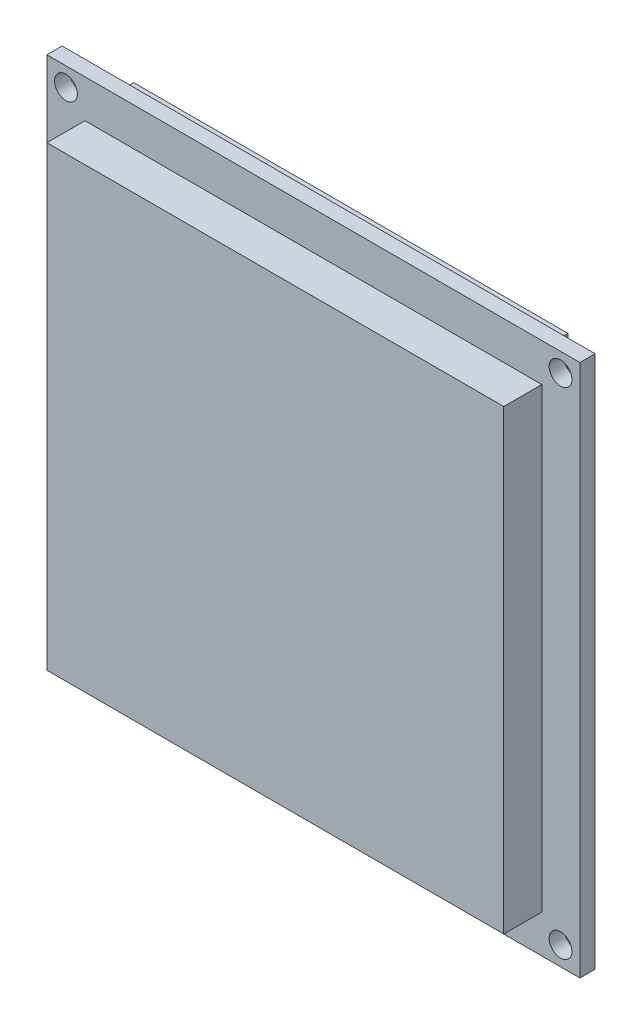
ISO-10303-21;
HEADER;
FILE_DESCRIPTION(('STEP AP214'),'2;1');
FILE_NAME('part.step','',(''),(''),'','','');
FILE_SCHEMA(('AUTOMOTIVE_DESIGN { 1 0 10303 214 1 1 1 1 }'));
ENDSEC;
DATA;
#1=APPLICATION_CONTEXT('core data for automotive mechanical design processes');
#2=APPLICATION_PROTOCOL_DEFINITION('international standard','automotive_design',2000,#1);
#3=PRODUCT_CONTEXT('',#1,'mechanical');
#4=PRODUCT('Part','Part','',(#3));
#5=PRODUCT_RELATED_PRODUCT_CATEGORY('part','',(#4));
#6=PRODUCT_DEFINITION_FORMATION('','',#4);
#7=PRODUCT_DEFINITION_CONTEXT('part definition',#1,'design');
#8=PRODUCT_DEFINITION('design','',#6,#7);
#9=PRODUCT_DEFINITION_SHAPE('','',#8);
#10=(LENGTH_UNIT() NAMED_UNIT(*) SI_UNIT(.MILLI.,.METRE.));
#11=(NAMED_UNIT(*) PLANE_ANGLE_UNIT() SI_UNIT($,.RADIAN.));
#12=(NAMED_UNIT(*) SI_UNIT($,.STERADIAN.) SOLID_ANGLE_UNIT());
#13=UNCERTAINTY_MEASURE_WITH_UNIT(LENGTH_MEASURE(1.E-05),#10,'distance_accuracy_value','');
#14=(GEOMETRIC_REPRESENTATION_CONTEXT(3) GLOBAL_UNCERTAINTY_ASSIGNED_CONTEXT((#13)) GLOBAL_UNIT_ASSIGNED_CONTEXT((#10,
#11,#12)) REPRESENTATION_CONTEXT('',''));
#15=CARTESIAN_POINT('',(0.,0.,0.));
#16=DIRECTION('',(0.,0.,1.));
#17=DIRECTION('',(1.,0.,0.));
#18=AXIS2_PLACEMENT_3D('',#15,#16,#17);
#19=CARTESIAN_POINT('',(28.4514096874915,0.,-3.));
#20=DIRECTION('',(-1.,0.,0.));
#21=DIRECTION('',(0.,0.,1.));
#22=AXIS2_PLACEMENT_3D('',#19,#20,#21);
#23=PLANE('',#22);
#24=DIRECTION('',(0.,-1.,0.));
#25=VECTOR('',#24,1.);
#26=CARTESIAN_POINT('',(28.4514096874915,0.,0.));
#27=LINE('',#26,#25);
#28=CARTESIAN_POINT('',(28.4514096874915,32.5200304427109,0.));
#29=VERTEX_POINT('',#28);
#30=CARTESIAN_POINT('',(28.4514096874915,11.4523529624222,0.));
#31=VERTEX_POINT('',#30);
#32=EDGE_CURVE('E318',#29,#31,#27,.T.);
#33=ORIENTED_EDGE('',*,*,#32,.T.);
#34=DIRECTION('',(0.,0.,1.));
#35=VECTOR('',#34,1.);
#36=CARTESIAN_POINT('',(28.4514096874915,11.4523529624222,-3.));
#37=LINE('',#36,#35);
#38=CARTESIAN_POINT('',(28.4514096874915,11.4523529624222,-3.));
#39=VERTEX_POINT('',#38);
#40=EDGE_CURVE('E13',#39,#31,#37,.T.);
#41=ORIENTED_EDGE('',*,*,#40,.F.);
#42=DIRECTION('',(0.,-1.,0.));
#43=VECTOR('',#42,1.);
#44=CARTESIAN_POINT('',(28.4514096874915,0.,-3.));
#45=LINE('',#44,#43);
#46=CARTESIAN_POINT('',(28.4514096874915,32.5200304427109,-3.));
#47=VERTEX_POINT('',#46);
#48=EDGE_CURVE('E274',#47,#39,#45,.T.);
#49=ORIENTED_EDGE('',*,*,#48,.F.);
#50=DIRECTION('',(0.,0.,1.));
#51=VECTOR('',#50,1.);
#52=CARTESIAN_POINT('',(28.4514096874915,32.5200304427109,-3.));
#53=LINE('',#52,#51);
#54=EDGE_CURVE('E259',#47,#29,#53,.T.);
#55=ORIENTED_EDGE('',*,*,#54,.T.);
#56=EDGE_LOOP('',(#33,#41,#49,#55));
#57=FACE_BOUND('',#56,.T.);
#58=ADVANCED_FACE('F256',(#57),#23,.F.);
#59=CARTESIAN_POINT('',(0.,11.4523529624222,-3.));
#60=DIRECTION('',(0.,-1.,0.));
#61=DIRECTION('',(0.,0.,-1.));
#62=AXIS2_PLACEMENT_3D('',#59,#60,#61);
#63=PLANE('',#62);
#64=DIRECTION('',(1.,0.,0.));
#65=VECTOR('',#64,1.);
#66=CARTESIAN_POINT('',(0.,11.4523529624222,0.));
#67=LINE('',#66,#65);
#68=CARTESIAN_POINT('',(-28.5744722630188,11.4523529624222,0.));
#69=VERTEX_POINT('',#68);
#70=EDGE_CURVE('E323',#69,#31,#67,.T.);
#71=ORIENTED_EDGE('',*,*,#70,.F.);
#72=DIRECTION('',(0.,0.,1.));
#73=VECTOR('',#72,1.);
#74=CARTESIAN_POINT('',(-28.5744722630188,11.4523529624222,-3.));
#75=LINE('',#74,#73);
#76=CARTESIAN_POINT('',(-28.5744722630188,11.4523529624222,-3.));
#77=VERTEX_POINT('',#76);
#78=EDGE_CURVE('E265',#77,#69,#75,.T.);
#79=ORIENTED_EDGE('',*,*,#78,.F.);
#80=DIRECTION('',(1.,0.,0.));
#81=VECTOR('',#80,1.);
#82=CARTESIAN_POINT('',(0.,11.4523529624222,-3.));
#83=LINE('',#82,#81);
#84=EDGE_CURVE('E313',#77,#39,#83,.T.);
#85=ORIENTED_EDGE('',*,*,#84,.T.);
#86=ORIENTED_EDGE('',*,*,#40,.T.);
#87=EDGE_LOOP('',(#71,#79,#85,#86));
#88=FACE_BOUND('',#87,.T.);
#89=ADVANCED_FACE('F329',(#88),#63,.T.);
#90=CARTESIAN_POINT('',(-28.5744722630188,0.,-3.));
#91=DIRECTION('',(-1.,0.,0.));
#92=DIRECTION('',(0.,0.,1.));
#93=AXIS2_PLACEMENT_3D('',#90,#91,#92);
#94=PLANE('',#93);
#95=DIRECTION('',(0.,-1.,0.));
#96=VECTOR('',#95,1.);
#97=CARTESIAN_POINT('',(-28.5744722630188,0.,0.));
#98=LINE('',#97,#96);
#99=CARTESIAN_POINT('',(-28.5744722630188,32.5200304427109,0.));
#100=VERTEX_POINT('',#99);
#101=EDGE_CURVE('E306',#100,#69,#98,.T.);
#102=ORIENTED_EDGE('',*,*,#101,.F.);
#103=DIRECTION('',(0.,0.,1.));
#104=VECTOR('',#103,1.);
#105=CARTESIAN_POINT('',(-28.5744722630188,32.5200304427109,-3.));
#106=LINE('',#105,#104);
#107=CARTESIAN_POINT('',(-28.5744722630188,32.5200304427109,-3.));
#108=VERTEX_POINT('',#107);
#109=EDGE_CURVE('E303',#108,#100,#106,.T.);
#110=ORIENTED_EDGE('',*,*,#109,.F.);
#111=DIRECTION('',(0.,-1.,0.));
#112=VECTOR('',#111,1.);
#113=CARTESIAN_POINT('',(-28.5744722630188,0.,-3.));
#114=LINE('',#113,#112);
#115=EDGE_CURVE('E305',#108,#77,#114,.T.);
#116=ORIENTED_EDGE('',*,*,#115,.T.);
#117=ORIENTED_EDGE('',*,*,#78,.T.);
#118=EDGE_LOOP('',(#102,#110,#116,#117));
#119=FACE_BOUND('',#118,.T.);
#120=ADVANCED_FACE('F304',(#119),#94,.T.);
#121=CARTESIAN_POINT('',(0.,32.5200304427109,-3.));
#122=DIRECTION('',(0.,-1.,0.));
#123=DIRECTION('',(0.,0.,-1.));
#124=AXIS2_PLACEMENT_3D('',#121,#122,#123);
#125=PLANE('',#124);
#126=DIRECTION('',(1.,0.,0.));
#127=VECTOR('',#126,1.);
#128=CARTESIAN_POINT('',(0.,32.5200304427109,0.));
#129=LINE('',#128,#127);
#130=EDGE_CURVE('E320',#100,#29,#129,.T.);
#131=ORIENTED_EDGE('',*,*,#130,.T.);
#132=ORIENTED_EDGE('',*,*,#54,.F.);
#133=DIRECTION('',(1.,0.,0.));
#134=VECTOR('',#133,1.);
#135=CARTESIAN_POINT('',(0.,32.5200304427109,-3.));
#136=LINE('',#135,#134);
#137=EDGE_CURVE('E300',#108,#47,#136,.T.);
#138=ORIENTED_EDGE('',*,*,#137,.F.);
#139=ORIENTED_EDGE('',*,*,#109,.T.);
#140=EDGE_LOOP('',(#131,#132,#138,#139));
#141=FACE_BOUND('',#140,.T.);
#142=ADVANCED_FACE('F309',(#141),#125,.F.);
#143=CARTESIAN_POINT('',(0.,0.,-3.));
#144=DIRECTION('',(0.,0.,1.));
#145=DIRECTION('',(1.,0.,0.));
#146=AXIS2_PLACEMENT_3D('',#143,#144,#145);
#147=PLANE('',#146);
#148=ORIENTED_EDGE('',*,*,#48,.T.);
#149=ORIENTED_EDGE('',*,*,#84,.F.);
#150=ORIENTED_EDGE('',*,*,#115,.F.);
#151=ORIENTED_EDGE('',*,*,#137,.T.);
#152=EDGE_LOOP('',(#148,#149,#150,#151));
#153=FACE_BOUND('',#152,.T.);
#154=ADVANCED_FACE('F312',(#153),#147,.F.);
#155=CARTESIAN_POINT('',(0.,0.,0.));
#156=DIRECTION('',(0.,0.,1.));
#157=DIRECTION('',(1.,0.,0.));
#158=AXIS2_PLACEMENT_3D('',#155,#156,#157);
#159=PLANE('',#158);
#160=ORIENTED_EDGE('',*,*,#32,.F.);
#161=ORIENTED_EDGE('',*,*,#130,.F.);
#162=ORIENTED_EDGE('',*,*,#101,.T.);
#163=ORIENTED_EDGE('',*,*,#70,.T.);
#164=EDGE_LOOP('',(#160,#161,#162,#163));
#165=FACE_BOUND('',#164,.T.);
#166=ADVANCED_FACE('F328',(#165),#159,.T.);
#167=CLOSED_SHELL('',(#58,#89,#120,#142,#154,#166));
#168=MANIFOLD_SOLID_BREP('B2',#167);
#169=CARTESIAN_POINT('',(-11.0428094319523,0.,-3.));
#170=DIRECTION('',(1.,0.,0.));
#171=DIRECTION('',(0.,0.,-1.));
#172=AXIS2_PLACEMENT_3D('',#169,#170,#171);
#173=PLANE('',#172);
#174=DIRECTION('',(0.,1.,0.));
#175=VECTOR('',#174,1.);
#176=CARTESIAN_POINT('',(-11.0428094319523,0.,0.));
#177=LINE('',#176,#175);
#178=CARTESIAN_POINT('',(-11.0428094319523,-35.0200304427109,0.));
#179=VERTEX_POINT('',#178);
#180=CARTESIAN_POINT('',(-11.0428094319523,-28.4262912070403,0.));
#181=VERTEX_POINT('',#180);
#182=EDGE_CURVE('E509',#179,#181,#177,.T.);
#183=ORIENTED_EDGE('',*,*,#182,.T.);
#184=DIRECTION('',(0.,0.,1.));
#185=VECTOR('',#184,1.);
#186=CARTESIAN_POINT('',(-11.0428094319523,-28.4262912070403,-3.));
#187=LINE('',#186,#185);
#188=CARTESIAN_POINT('',(-11.0428094319523,-28.4262912070403,-3.));
#189=VERTEX_POINT('',#188);
#190=EDGE_CURVE('E254',#189,#181,#187,.T.);
#191=ORIENTED_EDGE('',*,*,#190,.F.);
#192=DIRECTION('',(0.,1.,0.));
#193=VECTOR('',#192,1.);
#194=CARTESIAN_POINT('',(-11.0428094319523,0.,-3.));
#195=LINE('',#194,#193);
#196=CARTESIAN_POINT('',(-11.0428094319523,-35.0200304427109,-3.));
#197=VERTEX_POINT('',#196);
#198=EDGE_CURVE('E422',#197,#189,#195,.T.);
#199=ORIENTED_EDGE('',*,*,#198,.F.);
#200=DIRECTION('',(0.,0.,1.));
#201=VECTOR('',#200,1.);
#202=CARTESIAN_POINT('',(-11.0428094319523,-35.0200304427109,-3.));
#203=LINE('',#202,#201);
#204=EDGE_CURVE('E400',#197,#179,#203,.T.);
#205=ORIENTED_EDGE('',*,*,#204,.T.);
#206=EDGE_LOOP('',(#183,#191,#199,#205));
#207=FACE_BOUND('',#206,.T.);
#208=ADVANCED_FACE('F397',(#207),#173,.F.);
#209=CARTESIAN_POINT('',(0.,-28.4262912070403,-3.));
#210=DIRECTION('',(0.,1.,0.));
#211=DIRECTION('',(0.,0.,1.));
#212=AXIS2_PLACEMENT_3D('',#209,#210,#211);
#213=PLANE('',#212);
#214=DIRECTION('',(-1.,0.,0.));
#215=VECTOR('',#214,1.);
#216=CARTESIAN_POINT('',(0.,-28.4262912070403,0.));
#217=LINE('',#216,#215);
#218=CARTESIAN_POINT('',(11.0828703173741,-28.4262912070403,0.));
#219=VERTEX_POINT('',#218);
#220=EDGE_CURVE('E511',#219,#181,#217,.T.);
#221=ORIENTED_EDGE('',*,*,#220,.F.);
#222=DIRECTION('',(0.,0.,1.));
#223=VECTOR('',#222,1.);
#224=CARTESIAN_POINT('',(11.0828703173741,-28.4262912070403,-3.));
#225=LINE('',#224,#223);
#226=CARTESIAN_POINT('',(11.0828703173741,-28.4262912070403,-3.));
#227=VERTEX_POINT('',#226);
#228=EDGE_CURVE('E405',#227,#219,#225,.T.);
#229=ORIENTED_EDGE('',*,*,#228,.F.);
#230=DIRECTION('',(-1.,0.,0.));
#231=VECTOR('',#230,1.);
#232=CARTESIAN_POINT('',(0.,-28.4262912070403,-3.));
#233=LINE('',#232,#231);
#234=EDGE_CURVE('E516',#227,#189,#233,.T.);
#235=ORIENTED_EDGE('',*,*,#234,.T.);
#236=ORIENTED_EDGE('',*,*,#190,.T.);
#237=EDGE_LOOP('',(#221,#229,#235,#236));
#238=FACE_BOUND('',#237,.T.);
#239=ADVANCED_FACE('F535',(#238),#213,.T.);
#240=CARTESIAN_POINT('',(11.0828703173741,0.,-3.));
#241=DIRECTION('',(1.,0.,0.));
#242=DIRECTION('',(0.,0.,-1.));
#243=AXIS2_PLACEMENT_3D('',#240,#241,#242);
#244=PLANE('',#243);
#245=DIRECTION('',(0.,1.,0.));
#246=VECTOR('',#245,1.);
#247=CARTESIAN_POINT('',(11.0828703173741,0.,0.));
#248=LINE('',#247,#246);
#249=CARTESIAN_POINT('',(11.0828703173741,-35.0200304427109,0.));
#250=VERTEX_POINT('',#249);
#251=EDGE_CURVE('E521',#250,#219,#248,.T.);
#252=ORIENTED_EDGE('',*,*,#251,.F.);
#253=DIRECTION('',(0.,0.,1.));
#254=VECTOR('',#253,1.);
#255=CARTESIAN_POINT('',(11.0828703173741,-35.0200304427109,-3.));
#256=LINE('',#255,#254);
#257=CARTESIAN_POINT('',(11.0828703173741,-35.0200304427109,-3.));
#258=VERTEX_POINT('',#257);
#259=EDGE_CURVE('E526',#258,#250,#256,.T.);
#260=ORIENTED_EDGE('',*,*,#259,.F.);
#261=DIRECTION('',(0.,1.,0.));
#262=VECTOR('',#261,1.);
#263=CARTESIAN_POINT('',(11.0828703173741,0.,-3.));
#264=LINE('',#263,#262);
#265=EDGE_CURVE('E513',#258,#227,#264,.T.);
#266=ORIENTED_EDGE('',*,*,#265,.T.);
#267=ORIENTED_EDGE('',*,*,#228,.T.);
#268=EDGE_LOOP('',(#252,#260,#266,#267));
#269=FACE_BOUND('',#268,.T.);
#270=ADVANCED_FACE('F537',(#269),#244,.T.);
#271=CARTESIAN_POINT('',(0.,-35.0200304427109,-3.));
#272=DIRECTION('',(0.,1.,0.));
#273=DIRECTION('',(0.,0.,1.));
#274=AXIS2_PLACEMENT_3D('',#271,#272,#273);
#275=PLANE('',#274);
#276=DIRECTION('',(0.,0.,-1.));
#277=VECTOR('',#276,1.);
#278=CARTESIAN_POINT('',(-10.5428094319523,-35.0200304427109,-0.5));
#279=LINE('',#278,#277);
#280=CARTESIAN_POINT('',(-10.5428094319523,-35.0200304427109,-0.5));
#281=VERTEX_POINT('',#280);
#282=CARTESIAN_POINT('',(-10.5428094319523,-35.0200304427109,-2.5));
#283=VERTEX_POINT('',#282);
#284=EDGE_CURVE('E495',#281,#283,#279,.T.);
#285=ORIENTED_EDGE('',*,*,#284,.F.);
#286=DIRECTION('',(-1.,0.,0.));
#287=VECTOR('',#286,1.);
#288=CARTESIAN_POINT('',(10.5828703173741,-35.0200304427109,-0.5));
#289=LINE('',#288,#287);
#290=CARTESIAN_POINT('',(10.5828703173741,-35.0200304427109,-0.5));
#291=VERTEX_POINT('',#290);
#292=EDGE_CURVE('E488',#291,#281,#289,.T.);
#293=ORIENTED_EDGE('',*,*,#292,.F.);
#294=DIRECTION('',(0.,0.,1.));
#295=VECTOR('',#294,1.);
#296=CARTESIAN_POINT('',(10.5828703173741,-35.0200304427109,-2.5));
#297=LINE('',#296,#295);
#298=CARTESIAN_POINT('',(10.5828703173741,-35.0200304427109,-2.5));
#299=VERTEX_POINT('',#298);
#300=EDGE_CURVE('E499',#299,#291,#297,.T.);
#301=ORIENTED_EDGE('',*,*,#300,.F.);
#302=DIRECTION('',(1.,0.,0.));
#303=VECTOR('',#302,1.);
#304=CARTESIAN_POINT('',(-10.5428094319523,-35.0200304427109,-2.5));
#305=LINE('',#304,#303);
#306=EDGE_CURVE('E413',#283,#299,#305,.T.);
#307=ORIENTED_EDGE('',*,*,#306,.F.);
#308=EDGE_LOOP('',(#285,#293,#301,#307));
#309=FACE_BOUND('',#308,.T.);
#310=DIRECTION('',(-1.,0.,0.));
#311=VECTOR('',#310,1.);
#312=CARTESIAN_POINT('',(0.,-35.0200304427109,0.));
#313=LINE('',#312,#311);
#314=EDGE_CURVE('E519',#250,#179,#313,.T.);
#315=ORIENTED_EDGE('',*,*,#314,.T.);
#316=ORIENTED_EDGE('',*,*,#204,.F.);
#317=DIRECTION('',(-1.,0.,0.));
#318=VECTOR('',#317,1.);
#319=CARTESIAN_POINT('',(0.,-35.0200304427109,-3.));
#320=LINE('',#319,#318);
#321=EDGE_CURVE('E447',#258,#197,#320,.T.);
#322=ORIENTED_EDGE('',*,*,#321,.F.);
#323=ORIENTED_EDGE('',*,*,#259,.T.);
#324=EDGE_LOOP('',(#315,#316,#322,#323));
#325=FACE_BOUND('',#324,.T.);
#326=ADVANCED_FACE('F540',(#309,#325),#275,.F.);
#327=CARTESIAN_POINT('',(0.,0.,-3.));
#328=DIRECTION('',(0.,0.,1.));
#329=DIRECTION('',(1.,0.,0.));
#330=AXIS2_PLACEMENT_3D('',#327,#328,#329);
#331=PLANE('',#330);
#332=ORIENTED_EDGE('',*,*,#198,.T.);
#333=ORIENTED_EDGE('',*,*,#234,.F.);
#334=ORIENTED_EDGE('',*,*,#265,.F.);
#335=ORIENTED_EDGE('',*,*,#321,.T.);
#336=EDGE_LOOP('',(#332,#333,#334,#335));
#337=FACE_BOUND('',#336,.T.);
#338=ADVANCED_FACE('F538',(#337),#331,.F.);
#339=CARTESIAN_POINT('',(0.,0.,0.));
#340=DIRECTION('',(0.,0.,1.));
#341=DIRECTION('',(1.,0.,0.));
#342=AXIS2_PLACEMENT_3D('',#339,#340,#341);
#343=PLANE('',#342);
#344=ORIENTED_EDGE('',*,*,#182,.F.);
#345=ORIENTED_EDGE('',*,*,#314,.F.);
#346=ORIENTED_EDGE('',*,*,#251,.T.);
#347=ORIENTED_EDGE('',*,*,#220,.T.);
#348=EDGE_LOOP('',(#344,#345,#346,#347));
#349=FACE_BOUND('',#348,.T.);
#350=ADVANCED_FACE('F533',(#349),#343,.T.);
#351=CARTESIAN_POINT('',(0.,-29.4262912070403,-3.));
#352=DIRECTION('',(0.,1.,0.));
#353=DIRECTION('',(0.,0.,1.));
#354=AXIS2_PLACEMENT_3D('',#351,#352,#353);
#355=PLANE('',#354);
#356=DIRECTION('',(0.,0.,1.));
#357=VECTOR('',#356,1.);
#358=CARTESIAN_POINT('',(10.5828703173741,-29.4262912070403,-2.5));
#359=LINE('',#358,#357);
#360=CARTESIAN_POINT('',(10.5828703173741,-29.4262912070403,-2.5));
#361=VERTEX_POINT('',#360);
#362=CARTESIAN_POINT('',(10.5828703173741,-29.4262912070403,-0.5));
#363=VERTEX_POINT('',#362);
#364=EDGE_CURVE('E492',#361,#363,#359,.T.);
#365=ORIENTED_EDGE('',*,*,#364,.T.);
#366=DIRECTION('',(-1.,0.,0.));
#367=VECTOR('',#366,1.);
#368=CARTESIAN_POINT('',(10.5828703173741,-29.4262912070403,-0.5));
#369=LINE('',#368,#367);
#370=CARTESIAN_POINT('',(-10.5428094319523,-29.4262912070403,-0.5));
#371=VERTEX_POINT('',#370);
#372=EDGE_CURVE('E485',#363,#371,#369,.T.);
#373=ORIENTED_EDGE('',*,*,#372,.T.);
#374=DIRECTION('',(0.,0.,-1.));
#375=VECTOR('',#374,1.);
#376=CARTESIAN_POINT('',(-10.5428094319523,-29.4262912070403,-0.5));
#377=LINE('',#376,#375);
#378=CARTESIAN_POINT('',(-10.5428094319523,-29.4262912070403,-2.5));
#379=VERTEX_POINT('',#378);
#380=EDGE_CURVE('E472',#371,#379,#377,.T.);
#381=ORIENTED_EDGE('',*,*,#380,.T.);
#382=DIRECTION('',(1.,0.,0.));
#383=VECTOR('',#382,1.);
#384=CARTESIAN_POINT('',(-10.5428094319523,-29.4262912070403,-2.5));
#385=LINE('',#384,#383);
#386=EDGE_CURVE('E504',#379,#361,#385,.T.);
#387=ORIENTED_EDGE('',*,*,#386,.T.);
#388=EDGE_LOOP('',(#365,#373,#381,#387));
#389=FACE_BOUND('',#388,.T.);
#390=ADVANCED_FACE('F491',(#389),#355,.F.);
#391=CARTESIAN_POINT('',(10.5828703173741,-7.20615113042677,-0.5));
#392=DIRECTION('',(0.,0.,1.));
#393=DIRECTION('',(1.,0.,0.));
#394=AXIS2_PLACEMENT_3D('',#391,#392,#393);
#395=PLANE('',#394);
#396=DIRECTION('',(0.,-1.,0.));
#397=VECTOR('',#396,1.);
#398=CARTESIAN_POINT('',(10.5828703173741,-7.20615113042677,-0.5));
#399=LINE('',#398,#397);
#400=EDGE_CURVE('E502',#363,#291,#399,.T.);
#401=ORIENTED_EDGE('',*,*,#400,.T.);
#402=ORIENTED_EDGE('',*,*,#292,.T.);
#403=DIRECTION('',(0.,-1.,0.));
#404=VECTOR('',#403,1.);
#405=CARTESIAN_POINT('',(-10.5428094319523,-7.20615113042677,-0.5));
#406=LINE('',#405,#404);
#407=EDGE_CURVE('E476',#371,#281,#406,.T.);
#408=ORIENTED_EDGE('',*,*,#407,.F.);
#409=ORIENTED_EDGE('',*,*,#372,.F.);
#410=EDGE_LOOP('',(#401,#402,#408,#409));
#411=FACE_BOUND('',#410,.T.);
#412=ADVANCED_FACE('F484',(#411),#395,.F.);
#413=CARTESIAN_POINT('',(-10.5428094319523,-7.20615113042677,-0.5));
#414=DIRECTION('',(-1.,0.,0.));
#415=DIRECTION('',(0.,0.,1.));
#416=AXIS2_PLACEMENT_3D('',#413,#414,#415);
#417=PLANE('',#416);
#418=ORIENTED_EDGE('',*,*,#407,.T.);
#419=ORIENTED_EDGE('',*,*,#284,.T.);
#420=DIRECTION('',(0.,-1.,0.));
#421=VECTOR('',#420,1.);
#422=CARTESIAN_POINT('',(-10.5428094319523,-7.20615113042677,-2.5));
#423=LINE('',#422,#421);
#424=EDGE_CURVE('E478',#379,#283,#423,.T.);
#425=ORIENTED_EDGE('',*,*,#424,.F.);
#426=ORIENTED_EDGE('',*,*,#380,.F.);
#427=EDGE_LOOP('',(#418,#419,#425,#426));
#428=FACE_BOUND('',#427,.T.);
#429=ADVANCED_FACE('F474',(#428),#417,.F.);
#430=CARTESIAN_POINT('',(-10.5428094319523,-7.20615113042677,-2.5));
#431=DIRECTION('',(0.,0.,-1.));
#432=DIRECTION('',(-1.,0.,0.));
#433=AXIS2_PLACEMENT_3D('',#430,#431,#432);
#434=PLANE('',#433);
#435=ORIENTED_EDGE('',*,*,#424,.T.);
#436=ORIENTED_EDGE('',*,*,#306,.T.);
#437=DIRECTION('',(0.,-1.,0.));
#438=VECTOR('',#437,1.);
#439=CARTESIAN_POINT('',(10.5828703173741,-7.20615113042677,-2.5));
#440=LINE('',#439,#438);
#441=EDGE_CURVE('E503',#361,#299,#440,.T.);
#442=ORIENTED_EDGE('',*,*,#441,.F.);
#443=ORIENTED_EDGE('',*,*,#386,.F.);
#444=EDGE_LOOP('',(#435,#436,#442,#443));
#445=FACE_BOUND('',#444,.T.);
#446=ADVANCED_FACE('F593',(#445),#434,.F.);
#447=CARTESIAN_POINT('',(10.5828703173741,-7.20615113042677,-2.5));
#448=DIRECTION('',(1.,0.,0.));
#449=DIRECTION('',(0.,0.,-1.));
#450=AXIS2_PLACEMENT_3D('',#447,#448,#449);
#451=PLANE('',#450);
#452=ORIENTED_EDGE('',*,*,#441,.T.);
#453=ORIENTED_EDGE('',*,*,#300,.T.);
#454=ORIENTED_EDGE('',*,*,#400,.F.);
#455=ORIENTED_EDGE('',*,*,#364,.F.);
#456=EDGE_LOOP('',(#452,#453,#454,#455));
#457=FACE_BOUND('',#456,.T.);
#458=ADVANCED_FACE('F602',(#457),#451,.F.);
#459=CLOSED_SHELL('',(#208,#239,#270,#326,#338,#350,#390,#412,#429,#446,#458));
#460=MANIFOLD_SOLID_BREP('B7',#459);
#461=CARTESIAN_POINT('',(0.,0.,7.));
#462=DIRECTION('',(0.,0.,1.));
#463=DIRECTION('',(1.,0.,0.));
#464=AXIS2_PLACEMENT_3D('',#461,#462,#463);
#465=PLANE('',#464);
#466=DIRECTION('',(-1.,0.,0.));
#467=VECTOR('',#466,1.);
#468=CARTESIAN_POINT('',(30.0200304427109,-30.0200304427109,7.00000000000001));
#469=LINE('',#468,#467);
#470=CARTESIAN_POINT('',(30.0200304427109,-30.0200304427109,7.00000000000001));
#471=VERTEX_POINT('',#470);
#472=CARTESIAN_POINT('',(-29.9799695572891,-30.0200304427109,7.00000000000003));
#473=VERTEX_POINT('',#472);
#474=EDGE_CURVE('E694',#471,#473,#469,.T.);
#475=ORIENTED_EDGE('',*,*,#474,.F.);
#476=DIRECTION('',(0.,1.,0.));
#477=VECTOR('',#476,1.);
#478=CARTESIAN_POINT('',(30.0200304427109,-30.0200304427109,7.00000000000001));
#479=LINE('',#478,#477);
#480=CARTESIAN_POINT('',(30.0200304427109,29.9799695572891,7.00000000000001));
#481=VERTEX_POINT('',#480);
#482=EDGE_CURVE('E715',#471,#481,#479,.T.);
#483=ORIENTED_EDGE('',*,*,#482,.T.);
#484=DIRECTION('',(-1.,0.,0.));
#485=VECTOR('',#484,1.);
#486=CARTESIAN_POINT('',(30.0200304427109,29.9799695572891,7.00000000000001));
#487=LINE('',#486,#485);
#488=CARTESIAN_POINT('',(-29.9799695572891,29.9799695572891,7.00000000000001));
#489=VERTEX_POINT('',#488);
#490=EDGE_CURVE('E719',#481,#489,#487,.T.);
#491=ORIENTED_EDGE('',*,*,#490,.T.);
#492=DIRECTION('',(0.,1.,0.));
#493=VECTOR('',#492,1.);
#494=CARTESIAN_POINT('',(-29.9799695572891,-30.0200304427109,7.00000000000001));
#495=LINE('',#494,#493);
#496=EDGE_CURVE('E683',#473,#489,#495,.T.);
#497=ORIENTED_EDGE('',*,*,#496,.F.);
#498=EDGE_LOOP('',(#475,#483,#491,#497));
#499=FACE_BOUND('',#498,.T.);
#500=ADVANCED_FACE('F660',(#499),#465,.T.);
#501=CARTESIAN_POINT('',(30.0200304427109,-30.0200304427109,96.8528137423857));
#502=DIRECTION('',(0.,-1.,0.));
#503=DIRECTION('',(0.,0.,-1.));
#504=AXIS2_PLACEMENT_3D('',#501,#502,#503);
#505=PLANE('',#504);
#506=DIRECTION('',(-1.,0.,0.));
#507=VECTOR('',#506,1.);
#508=CARTESIAN_POINT('',(30.0200304427109,-30.0200304427109,2.));
#509=LINE('',#508,#507);
#510=CARTESIAN_POINT('',(30.0200304427109,-30.0200304427109,2.));
#511=VERTEX_POINT('',#510);
#512=CARTESIAN_POINT('',(-29.9799695572891,-30.0200304427109,2.));
#513=VERTEX_POINT('',#512);
#514=EDGE_CURVE('E699',#511,#513,#509,.T.);
#515=ORIENTED_EDGE('',*,*,#514,.F.);
#516=DIRECTION('',(0.,0.,-1.));
#517=VECTOR('',#516,1.);
#518=CARTESIAN_POINT('',(30.0200304427109,-30.0200304427109,96.8528137423857));
#519=LINE('',#518,#517);
#520=EDGE_CURVE('E395',#471,#511,#519,.T.);
#521=ORIENTED_EDGE('',*,*,#520,.F.);
#522=ORIENTED_EDGE('',*,*,#474,.T.);
#523=DIRECTION('',(0.,0.,-1.));
#524=VECTOR('',#523,1.);
#525=CARTESIAN_POINT('',(-29.9799695572891,-30.0200304427109,96.8528137423857));
#526=LINE('',#525,#524);
#527=EDGE_CURVE('E714',#473,#513,#526,.T.);
#528=ORIENTED_EDGE('',*,*,#527,.T.);
#529=EDGE_LOOP('',(#515,#521,#522,#528));
#530=FACE_BOUND('',#529,.T.);
#531=ADVANCED_FACE('F713',(#530),#505,.T.);
#532=CARTESIAN_POINT('',(-29.9799695572891,-30.0200304427109,96.8528137423857));
#533=DIRECTION('',(-1.,0.,0.));
#534=DIRECTION('',(0.,0.,1.));
#535=AXIS2_PLACEMENT_3D('',#532,#533,#534);
#536=PLANE('',#535);
#537=DIRECTION('',(0.,1.,0.));
#538=VECTOR('',#537,1.);
#539=CARTESIAN_POINT('',(-29.9799695572891,-30.0200304427109,2.));
#540=LINE('',#539,#538);
#541=CARTESIAN_POINT('',(-29.9799695572891,29.9799695572891,2.00000000000003));
#542=VERTEX_POINT('',#541);
#543=EDGE_CURVE('E703',#513,#542,#540,.T.);
#544=ORIENTED_EDGE('',*,*,#543,.F.);
#545=ORIENTED_EDGE('',*,*,#527,.F.);
#546=ORIENTED_EDGE('',*,*,#496,.T.);
#547=DIRECTION('',(0.,0.,-1.));
#548=VECTOR('',#547,1.);
#549=CARTESIAN_POINT('',(-29.9799695572891,29.9799695572891,96.8528137423857));
#550=LINE('',#549,#548);
#551=EDGE_CURVE('E726',#489,#542,#550,.T.);
#552=ORIENTED_EDGE('',*,*,#551,.T.);
#553=EDGE_LOOP('',(#544,#545,#546,#552));
#554=FACE_BOUND('',#553,.T.);
#555=ADVANCED_FACE('F731',(#554),#536,.T.);
#556=CARTESIAN_POINT('',(30.0200304427109,29.9799695572891,96.8528137423857));
#557=DIRECTION('',(0.,-1.,0.));
#558=DIRECTION('',(0.,0.,-1.));
#559=AXIS2_PLACEMENT_3D('',#556,#557,#558);
#560=PLANE('',#559);
#561=DIRECTION('',(0.,0.,-1.));
#562=VECTOR('',#561,1.);
#563=CARTESIAN_POINT('',(30.0200304427109,29.9799695572891,96.8528137423857));
#564=LINE('',#563,#562);
#565=CARTESIAN_POINT('',(30.0200304427109,29.9799695572891,2.00000000000006));
#566=VERTEX_POINT('',#565);
#567=EDGE_CURVE('E667',#481,#566,#564,.T.);
#568=ORIENTED_EDGE('',*,*,#567,.T.);
#569=DIRECTION('',(-1.,0.,0.));
#570=VECTOR('',#569,1.);
#571=CARTESIAN_POINT('',(30.0200304427109,29.9799695572891,2.));
#572=LINE('',#571,#570);
#573=EDGE_CURVE('E674',#566,#542,#572,.T.);
#574=ORIENTED_EDGE('',*,*,#573,.T.);
#575=ORIENTED_EDGE('',*,*,#551,.F.);
#576=ORIENTED_EDGE('',*,*,#490,.F.);
#577=EDGE_LOOP('',(#568,#574,#575,#576));
#578=FACE_BOUND('',#577,.T.);
#579=ADVANCED_FACE('F733',(#578),#560,.F.);
#580=CARTESIAN_POINT('',(30.0200304427109,-30.0200304427109,96.8528137423857));
#581=DIRECTION('',(-1.,0.,0.));
#582=DIRECTION('',(0.,0.,1.));
#583=AXIS2_PLACEMENT_3D('',#580,#581,#582);
#584=PLANE('',#583);
#585=ORIENTED_EDGE('',*,*,#520,.T.);
#586=DIRECTION('',(0.,1.,0.));
#587=VECTOR('',#586,1.);
#588=CARTESIAN_POINT('',(30.0200304427109,-30.0200304427109,2.));
#589=LINE('',#588,#587);
#590=EDGE_CURVE('E704',#511,#566,#589,.T.);
#591=ORIENTED_EDGE('',*,*,#590,.T.);
#592=ORIENTED_EDGE('',*,*,#567,.F.);
#593=ORIENTED_EDGE('',*,*,#482,.F.);
#594=EDGE_LOOP('',(#585,#591,#592,#593));
#595=FACE_BOUND('',#594,.T.);
#596=ADVANCED_FACE('F717',(#595),#584,.F.);
#597=CARTESIAN_POINT('',(0.,0.,2.));
#598=DIRECTION('',(0.,0.,1.));
#599=DIRECTION('',(1.,0.,0.));
#600=AXIS2_PLACEMENT_3D('',#597,#598,#599);
#601=PLANE('',#600);
#602=ORIENTED_EDGE('',*,*,#514,.T.);
#603=ORIENTED_EDGE('',*,*,#543,.T.);
#604=ORIENTED_EDGE('',*,*,#573,.F.);
#605=ORIENTED_EDGE('',*,*,#590,.F.);
#606=EDGE_LOOP('',(#602,#603,#604,#605));
#607=FACE_BOUND('',#606,.T.);
#608=ADVANCED_FACE('F705',(#607),#601,.F.);
#609=CLOSED_SHELL('',(#500,#531,#555,#579,#596,#608));
#610=MANIFOLD_SOLID_BREP('B248',#609);
#611=CARTESIAN_POINT('',(-32.4799695572891,32.5200304427109,2.));
#612=DIRECTION('',(0.,0.,-1.));
#613=DIRECTION('',(-1.,0.,0.));
#614=AXIS2_PLACEMENT_3D('',#611,#612,#613);
#615=CYLINDRICAL_SURFACE('',#614,1.5);
#616=CARTESIAN_POINT('',(-32.4799695572891,32.5200304427109,2.));
#617=DIRECTION('',(0.,0.,1.));
#618=DIRECTION('',(1.,0.,0.));
#619=AXIS2_PLACEMENT_3D('',#616,#617,#618);
#620=CIRCLE('',#619,1.5);
#621=CARTESIAN_POINT('',(-30.9799695572891,32.5200304427109,2.));
#622=VERTEX_POINT('',#621);
#623=EDGE_CURVE('E851',#622,#622,#620,.F.);
#624=ORIENTED_EDGE('',*,*,#623,.F.);
#625=EDGE_LOOP('',(#624));
#626=FACE_BOUND('',#625,.T.);
#627=CARTESIAN_POINT('',(-32.4799695572891,32.5200304427109,0.));
#628=DIRECTION('',(0.,0.,1.));
#629=DIRECTION('',(1.,0.,0.));
#630=AXIS2_PLACEMENT_3D('',#627,#628,#629);
#631=CIRCLE('',#630,1.5);
#632=CARTESIAN_POINT('',(-30.9799695572891,32.5200304427109,0.));
#633=VERTEX_POINT('',#632);
#634=EDGE_CURVE('E852',#633,#633,#631,.F.);
#635=ORIENTED_EDGE('',*,*,#634,.T.);
#636=EDGE_LOOP('',(#635));
#637=FACE_BOUND('',#636,.T.);
#638=ADVANCED_FACE('F784',(#626,#637),#615,.F.);
#639=CARTESIAN_POINT('',(32.4799695572891,32.5200304427109,2.));
#640=DIRECTION('',(0.,0.,-1.));
#641=DIRECTION('',(-1.,0.,0.));
#642=AXIS2_PLACEMENT_3D('',#639,#640,#641);
#643=CYLINDRICAL_SURFACE('',#642,1.5);
#644=CARTESIAN_POINT('',(32.4799695572891,32.5200304427109,2.));
#645=DIRECTION('',(0.,0.,1.));
#646=DIRECTION('',(1.,0.,0.));
#647=AXIS2_PLACEMENT_3D('',#644,#645,#646);
#648=CIRCLE('',#647,1.5);
#649=CARTESIAN_POINT('',(33.9799695572891,32.5200304427109,2.));
#650=VERTEX_POINT('',#649);
#651=EDGE_CURVE('E873',#650,#650,#648,.T.);
#652=ORIENTED_EDGE('',*,*,#651,.T.);
#653=EDGE_LOOP('',(#652));
#654=FACE_BOUND('',#653,.T.);
#655=CARTESIAN_POINT('',(32.4799695572891,32.5200304427109,0.));
#656=DIRECTION('',(0.,0.,1.));
#657=DIRECTION('',(1.,0.,0.));
#658=AXIS2_PLACEMENT_3D('',#655,#656,#657);
#659=CIRCLE('',#658,1.5);
#660=CARTESIAN_POINT('',(33.9799695572891,32.5200304427109,0.));
#661=VERTEX_POINT('',#660);
#662=EDGE_CURVE('E856',#661,#661,#659,.T.);
#663=ORIENTED_EDGE('',*,*,#662,.F.);
#664=EDGE_LOOP('',(#663));
#665=FACE_BOUND('',#664,.T.);
#666=ADVANCED_FACE('F901',(#654,#665),#643,.F.);
#667=CARTESIAN_POINT('',(0.,-35.0200304427109,2.));
#668=DIRECTION('',(0.,-1.,0.));
#669=DIRECTION('',(0.,0.,-1.));
#670=AXIS2_PLACEMENT_3D('',#667,#668,#669);
#671=PLANE('',#670);
#672=DIRECTION('',(-1.,0.,0.));
#673=VECTOR('',#672,1.);
#674=CARTESIAN_POINT('',(0.,-35.0200304427109,0.));
#675=LINE('',#674,#673);
#676=CARTESIAN_POINT('',(35.0200304427109,-35.0200304427109,0.));
#677=VERTEX_POINT('',#676);
#678=CARTESIAN_POINT('',(-34.9799695572891,-35.0200304427109,0.));
#679=VERTEX_POINT('',#678);
#680=EDGE_CURVE('E823',#677,#679,#675,.T.);
#681=ORIENTED_EDGE('',*,*,#680,.F.);
#682=DIRECTION('',(0.,0.,-1.));
#683=VECTOR('',#682,1.);
#684=CARTESIAN_POINT('',(35.0200304427109,-35.0200304427109,2.));
#685=LINE('',#684,#683);
#686=CARTESIAN_POINT('',(35.0200304427109,-35.0200304427109,2.));
#687=VERTEX_POINT('',#686);
#688=EDGE_CURVE('E658',#687,#677,#685,.T.);
#689=ORIENTED_EDGE('',*,*,#688,.F.);
#690=DIRECTION('',(-1.,0.,0.));
#691=VECTOR('',#690,1.);
#692=CARTESIAN_POINT('',(0.,-35.0200304427109,2.));
#693=LINE('',#692,#691);
#694=CARTESIAN_POINT('',(-34.9799695572891,-35.0200304427109,2.));
#695=VERTEX_POINT('',#694);
#696=EDGE_CURVE('E829',#687,#695,#693,.T.);
#697=ORIENTED_EDGE('',*,*,#696,.T.);
#698=DIRECTION('',(0.,0.,-1.));
#699=VECTOR('',#698,1.);
#700=CARTESIAN_POINT('',(-34.9799695572891,-35.0200304427109,2.));
#701=LINE('',#700,#699);
#702=EDGE_CURVE('E801',#695,#679,#701,.T.);
#703=ORIENTED_EDGE('',*,*,#702,.T.);
#704=EDGE_LOOP('',(#681,#689,#697,#703));
#705=FACE_BOUND('',#704,.T.);
#706=ADVANCED_FACE('F907',(#705),#671,.T.);
#707=CARTESIAN_POINT('',(35.0200304427109,0.,2.));
#708=DIRECTION('',(-1.,0.,0.));
#709=DIRECTION('',(0.,0.,1.));
#710=AXIS2_PLACEMENT_3D('',#707,#708,#709);
#711=PLANE('',#710);
#712=DIRECTION('',(0.,1.,0.));
#713=VECTOR('',#712,1.);
#714=CARTESIAN_POINT('',(35.0200304427109,0.,0.));
#715=LINE('',#714,#713);
#716=CARTESIAN_POINT('',(35.0200304427109,34.9799695572891,0.));
#717=VERTEX_POINT('',#716);
#718=EDGE_CURVE('E847',#677,#717,#715,.T.);
#719=ORIENTED_EDGE('',*,*,#718,.T.);
#720=DIRECTION('',(0.,0.,-1.));
#721=VECTOR('',#720,1.);
#722=CARTESIAN_POINT('',(35.0200304427109,34.9799695572891,2.));
#723=LINE('',#722,#721);
#724=CARTESIAN_POINT('',(35.0200304427109,34.9799695572891,2.));
#725=VERTEX_POINT('',#724);
#726=EDGE_CURVE('E793',#725,#717,#723,.T.);
#727=ORIENTED_EDGE('',*,*,#726,.F.);
#728=DIRECTION('',(0.,1.,0.));
#729=VECTOR('',#728,1.);
#730=CARTESIAN_POINT('',(35.0200304427109,0.,2.));
#731=LINE('',#730,#729);
#732=EDGE_CURVE('E839',#687,#725,#731,.T.);
#733=ORIENTED_EDGE('',*,*,#732,.F.);
#734=ORIENTED_EDGE('',*,*,#688,.T.);
#735=EDGE_LOOP('',(#719,#727,#733,#734));
#736=FACE_BOUND('',#735,.T.);
#737=ADVANCED_FACE('F846',(#736),#711,.F.);
#738=CARTESIAN_POINT('',(0.,34.9799695572891,2.));
#739=DIRECTION('',(0.,-1.,0.));
#740=DIRECTION('',(0.,0.,-1.));
#741=AXIS2_PLACEMENT_3D('',#738,#739,#740);
#742=PLANE('',#741);
#743=DIRECTION('',(-1.,0.,0.));
#744=VECTOR('',#743,1.);
#745=CARTESIAN_POINT('',(0.,34.9799695572891,0.));
#746=LINE('',#745,#744);
#747=CARTESIAN_POINT('',(-34.9799695572891,34.9799695572891,0.));
#748=VERTEX_POINT('',#747);
#749=EDGE_CURVE('E861',#717,#748,#746,.T.);
#750=ORIENTED_EDGE('',*,*,#749,.T.);
#751=DIRECTION('',(0.,0.,-1.));
#752=VECTOR('',#751,1.);
#753=CARTESIAN_POINT('',(-34.9799695572891,34.9799695572891,2.));
#754=LINE('',#753,#752);
#755=CARTESIAN_POINT('',(-34.9799695572891,34.9799695572891,2.));
#756=VERTEX_POINT('',#755);
#757=EDGE_CURVE('E815',#756,#748,#754,.T.);
#758=ORIENTED_EDGE('',*,*,#757,.F.);
#759=DIRECTION('',(-1.,0.,0.));
#760=VECTOR('',#759,1.);
#761=CARTESIAN_POINT('',(0.,34.9799695572891,2.));
#762=LINE('',#761,#760);
#763=EDGE_CURVE('E834',#725,#756,#762,.T.);
#764=ORIENTED_EDGE('',*,*,#763,.F.);
#765=ORIENTED_EDGE('',*,*,#726,.T.);
#766=EDGE_LOOP('',(#750,#758,#764,#765));
#767=FACE_BOUND('',#766,.T.);
#768=ADVANCED_FACE('F835',(#767),#742,.F.);
#769=CARTESIAN_POINT('',(-34.9799695572891,0.,2.));
#770=DIRECTION('',(-1.,0.,0.));
#771=DIRECTION('',(0.,0.,1.));
#772=AXIS2_PLACEMENT_3D('',#769,#770,#771);
#773=PLANE('',#772);
#774=DIRECTION('',(0.,1.,0.));
#775=VECTOR('',#774,1.);
#776=CARTESIAN_POINT('',(-34.9799695572891,0.,0.));
#777=LINE('',#776,#775);
#778=EDGE_CURVE('E859',#679,#748,#777,.T.);
#779=ORIENTED_EDGE('',*,*,#778,.F.);
#780=ORIENTED_EDGE('',*,*,#702,.F.);
#781=DIRECTION('',(0.,1.,0.));
#782=VECTOR('',#781,1.);
#783=CARTESIAN_POINT('',(-34.9799695572891,0.,2.));
#784=LINE('',#783,#782);
#785=EDGE_CURVE('E838',#695,#756,#784,.T.);
#786=ORIENTED_EDGE('',*,*,#785,.T.);
#787=ORIENTED_EDGE('',*,*,#757,.T.);
#788=EDGE_LOOP('',(#779,#780,#786,#787));
#789=FACE_BOUND('',#788,.T.);
#790=ADVANCED_FACE('F913',(#789),#773,.T.);
#791=CARTESIAN_POINT('',(-32.4799695572891,-32.5200304427109,2.));
#792=DIRECTION('',(0.,0.,-1.));
#793=DIRECTION('',(-1.,0.,0.));
#794=AXIS2_PLACEMENT_3D('',#791,#792,#793);
#795=CYLINDRICAL_SURFACE('',#794,1.5);
#796=CARTESIAN_POINT('',(-32.4799695572891,-32.5200304427109,2.));
#797=DIRECTION('',(0.,0.,1.));
#798=DIRECTION('',(1.,0.,0.));
#799=AXIS2_PLACEMENT_3D('',#796,#797,#798);
#800=CIRCLE('',#799,1.5);
#801=CARTESIAN_POINT('',(-30.9799695572891,-32.5200304427109,2.));
#802=VERTEX_POINT('',#801);
#803=EDGE_CURVE('E878',#802,#802,#800,.T.);
#804=ORIENTED_EDGE('',*,*,#803,.T.);
#805=EDGE_LOOP('',(#804));
#806=FACE_BOUND('',#805,.T.);
#807=CARTESIAN_POINT('',(-32.4799695572891,-32.5200304427109,0.));
#808=DIRECTION('',(0.,0.,1.));
#809=DIRECTION('',(1.,0.,0.));
#810=AXIS2_PLACEMENT_3D('',#807,#808,#809);
#811=CIRCLE('',#810,1.5);
#812=CARTESIAN_POINT('',(-30.9799695572891,-32.5200304427109,0.));
#813=VERTEX_POINT('',#812);
#814=EDGE_CURVE('E865',#813,#813,#811,.T.);
#815=ORIENTED_EDGE('',*,*,#814,.F.);
#816=EDGE_LOOP('',(#815));
#817=FACE_BOUND('',#816,.T.);
#818=ADVANCED_FACE('F888',(#806,#817),#795,.F.);
#819=CARTESIAN_POINT('',(32.4799695572891,-32.5200304427109,2.));
#820=DIRECTION('',(0.,0.,-1.));
#821=DIRECTION('',(-1.,0.,0.));
#822=AXIS2_PLACEMENT_3D('',#819,#820,#821);
#823=CYLINDRICAL_SURFACE('',#822,1.5);
#824=CARTESIAN_POINT('',(32.4799695572891,-32.5200304427109,2.));
#825=DIRECTION('',(0.,0.,1.));
#826=DIRECTION('',(1.,0.,0.));
#827=AXIS2_PLACEMENT_3D('',#824,#825,#826);
#828=CIRCLE('',#827,1.5);
#829=CARTESIAN_POINT('',(33.9799695572891,-32.5200304427109,2.));
#830=VERTEX_POINT('',#829);
#831=EDGE_CURVE('E855',#830,#830,#828,.F.);
#832=ORIENTED_EDGE('',*,*,#831,.F.);
#833=EDGE_LOOP('',(#832));
#834=FACE_BOUND('',#833,.T.);
#835=CARTESIAN_POINT('',(32.4799695572891,-32.5200304427109,0.));
#836=DIRECTION('',(0.,0.,1.));
#837=DIRECTION('',(1.,0.,0.));
#838=AXIS2_PLACEMENT_3D('',#835,#836,#837);
#839=CIRCLE('',#838,1.5);
#840=CARTESIAN_POINT('',(33.9799695572891,-32.5200304427109,0.));
#841=VERTEX_POINT('',#840);
#842=EDGE_CURVE('E868',#841,#841,#839,.F.);
#843=ORIENTED_EDGE('',*,*,#842,.T.);
#844=EDGE_LOOP('',(#843));
#845=FACE_BOUND('',#844,.T.);
#846=ADVANCED_FACE('F786',(#834,#845),#823,.F.);
#847=CARTESIAN_POINT('',(0.,0.,0.));
#848=DIRECTION('',(0.,0.,1.));
#849=DIRECTION('',(1.,0.,0.));
#850=AXIS2_PLACEMENT_3D('',#847,#848,#849);
#851=PLANE('',#850);
#852=ORIENTED_EDGE('',*,*,#680,.T.);
#853=ORIENTED_EDGE('',*,*,#778,.T.);
#854=ORIENTED_EDGE('',*,*,#749,.F.);
#855=ORIENTED_EDGE('',*,*,#718,.F.);
#856=EDGE_LOOP('',(#852,#853,#854,#855));
#857=FACE_BOUND('',#856,.T.);
#858=ORIENTED_EDGE('',*,*,#842,.F.);
#859=EDGE_LOOP('',(#858));
#860=FACE_BOUND('',#859,.T.);
#861=ORIENTED_EDGE('',*,*,#814,.T.);
#862=EDGE_LOOP('',(#861));
#863=FACE_BOUND('',#862,.T.);
#864=ORIENTED_EDGE('',*,*,#662,.T.);
#865=EDGE_LOOP('',(#864));
#866=FACE_BOUND('',#865,.T.);
#867=ORIENTED_EDGE('',*,*,#634,.F.);
#868=EDGE_LOOP('',(#867));
#869=FACE_BOUND('',#868,.T.);
#870=ADVANCED_FACE('F887',(#857,#860,#863,#866,#869),#851,.F.);
#871=CARTESIAN_POINT('',(0.,0.,2.));
#872=DIRECTION('',(0.,0.,1.));
#873=DIRECTION('',(1.,0.,0.));
#874=AXIS2_PLACEMENT_3D('',#871,#872,#873);
#875=PLANE('',#874);
#876=ORIENTED_EDGE('',*,*,#696,.F.);
#877=ORIENTED_EDGE('',*,*,#732,.T.);
#878=ORIENTED_EDGE('',*,*,#763,.T.);
#879=ORIENTED_EDGE('',*,*,#785,.F.);
#880=EDGE_LOOP('',(#876,#877,#878,#879));
#881=FACE_BOUND('',#880,.T.);
#882=ORIENTED_EDGE('',*,*,#831,.T.);
#883=EDGE_LOOP('',(#882));
#884=FACE_BOUND('',#883,.T.);
#885=ORIENTED_EDGE('',*,*,#803,.F.);
#886=EDGE_LOOP('',(#885));
#887=FACE_BOUND('',#886,.T.);
#888=ORIENTED_EDGE('',*,*,#651,.F.);
#889=EDGE_LOOP('',(#888));
#890=FACE_BOUND('',#889,.T.);
#891=ORIENTED_EDGE('',*,*,#623,.T.);
#892=EDGE_LOOP('',(#891));
#893=FACE_BOUND('',#892,.T.);
#894=ADVANCED_FACE('F842',(#881,#884,#887,#890,#893),#875,.T.);
#895=CLOSED_SHELL('',(#638,#666,#706,#737,#768,#790,#818,#846,#870,#894));
#896=MANIFOLD_SOLID_BREP('B389',#895);
#897=ADVANCED_BREP_SHAPE_REPRESENTATION('',(#18,#168,#460,#610,#896),#14);
#898=SHAPE_DEFINITION_REPRESENTATION(#9,#897);
ENDSEC;
END-ISO-10303-21;
